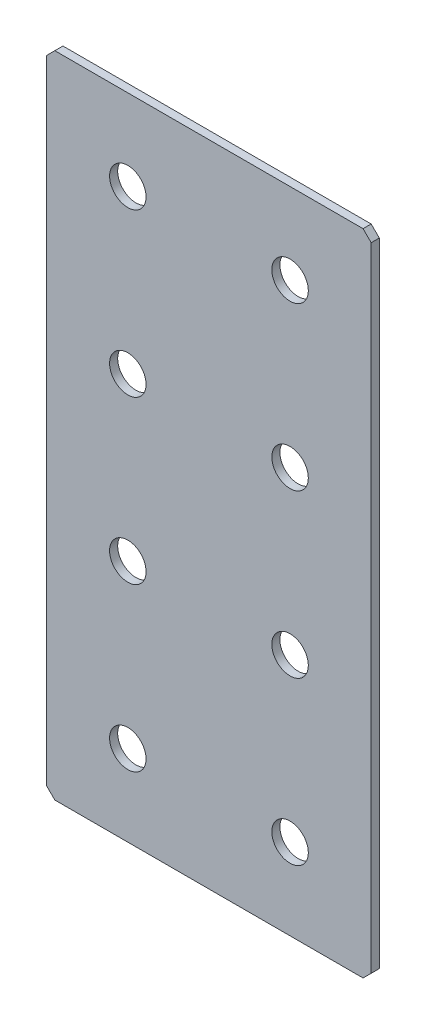
ISO-10303-21;
HEADER;
FILE_DESCRIPTION(('STEP AP214'),'2;1');
FILE_NAME('part.step','',(''),(''),'','','');
FILE_SCHEMA(('AUTOMOTIVE_DESIGN { 1 0 10303 214 1 1 1 1 }'));
ENDSEC;
DATA;
#1=APPLICATION_CONTEXT('core data for automotive mechanical design processes');
#2=APPLICATION_PROTOCOL_DEFINITION('international standard','automotive_design',2000,#1);
#3=PRODUCT_CONTEXT('',#1,'mechanical');
#4=PRODUCT('Part','Part','',(#3));
#5=PRODUCT_RELATED_PRODUCT_CATEGORY('part','',(#4));
#6=PRODUCT_DEFINITION_FORMATION('','',#4);
#7=PRODUCT_DEFINITION_CONTEXT('part definition',#1,'design');
#8=PRODUCT_DEFINITION('design','',#6,#7);
#9=PRODUCT_DEFINITION_SHAPE('','',#8);
#10=(LENGTH_UNIT() NAMED_UNIT(*) SI_UNIT(.MILLI.,.METRE.));
#11=(NAMED_UNIT(*) PLANE_ANGLE_UNIT() SI_UNIT($,.RADIAN.));
#12=(NAMED_UNIT(*) SI_UNIT($,.STERADIAN.) SOLID_ANGLE_UNIT());
#13=UNCERTAINTY_MEASURE_WITH_UNIT(LENGTH_MEASURE(1.E-05),#10,'distance_accuracy_value','');
#14=(GEOMETRIC_REPRESENTATION_CONTEXT(3) GLOBAL_UNCERTAINTY_ASSIGNED_CONTEXT((#13)) GLOBAL_UNIT_ASSIGNED_CONTEXT((#10,
#11,#12)) REPRESENTATION_CONTEXT('',''));
#15=CARTESIAN_POINT('',(0.,0.,0.));
#16=DIRECTION('',(0.,0.,1.));
#17=DIRECTION('',(1.,0.,0.));
#18=AXIS2_PLACEMENT_3D('',#15,#16,#17);
#19=CARTESIAN_POINT('',(40.,-80.,2.));
#20=DIRECTION('',(-1.,0.,0.));
#21=DIRECTION('',(0.,0.,1.));
#22=AXIS2_PLACEMENT_3D('',#19,#20,#21);
#23=PLANE('',#22);
#24=DIRECTION('',(0.,1.,0.));
#25=VECTOR('',#24,1.);
#26=CARTESIAN_POINT('',(40.,-80.,2.));
#27=LINE('',#26,#25);
#28=CARTESIAN_POINT('',(40.,-78.,2.));
#29=VERTEX_POINT('',#28);
#30=CARTESIAN_POINT('',(40.,78.,2.));
#31=VERTEX_POINT('',#30);
#32=EDGE_CURVE('E128',#29,#31,#27,.T.);
#33=ORIENTED_EDGE('',*,*,#32,.F.);
#34=DIRECTION('',(0.,0.,-1.));
#35=VECTOR('',#34,1.);
#36=CARTESIAN_POINT('',(40.,-78.,2.));
#37=LINE('',#36,#35);
#38=CARTESIAN_POINT('',(40.,-78.,0.));
#39=VERTEX_POINT('',#38);
#40=EDGE_CURVE('E154',#29,#39,#37,.T.);
#41=ORIENTED_EDGE('',*,*,#40,.T.);
#42=DIRECTION('',(0.,1.,0.));
#43=VECTOR('',#42,1.);
#44=CARTESIAN_POINT('',(40.,-80.,0.));
#45=LINE('',#44,#43);
#46=CARTESIAN_POINT('',(40.,78.,0.));
#47=VERTEX_POINT('',#46);
#48=EDGE_CURVE('E162',#39,#47,#45,.T.);
#49=ORIENTED_EDGE('',*,*,#48,.T.);
#50=DIRECTION('',(0.,0.,1.));
#51=VECTOR('',#50,1.);
#52=CARTESIAN_POINT('',(40.,78.,2.));
#53=LINE('',#52,#51);
#54=EDGE_CURVE('E152',#47,#31,#53,.T.);
#55=ORIENTED_EDGE('',*,*,#54,.T.);
#56=EDGE_LOOP('',(#33,#41,#49,#55));
#57=FACE_BOUND('',#56,.T.);
#58=ADVANCED_FACE('F37',(#57),#23,.F.);
#59=CARTESIAN_POINT('',(-40.,80.,2.));
#60=DIRECTION('',(0.,-1.,0.));
#61=DIRECTION('',(0.,0.,-1.));
#62=AXIS2_PLACEMENT_3D('',#59,#60,#61);
#63=PLANE('',#62);
#64=DIRECTION('',(-1.,0.,0.));
#65=VECTOR('',#64,1.);
#66=CARTESIAN_POINT('',(-40.,80.,0.));
#67=LINE('',#66,#65);
#68=CARTESIAN_POINT('',(38.,80.,0.));
#69=VERTEX_POINT('',#68);
#70=CARTESIAN_POINT('',(-38.,80.,0.));
#71=VERTEX_POINT('',#70);
#72=EDGE_CURVE('E133',#69,#71,#67,.T.);
#73=ORIENTED_EDGE('',*,*,#72,.T.);
#74=DIRECTION('',(0.,0.,1.));
#75=VECTOR('',#74,1.);
#76=CARTESIAN_POINT('',(-38.,80.,2.));
#77=LINE('',#76,#75);
#78=CARTESIAN_POINT('',(-38.,80.,2.));
#79=VERTEX_POINT('',#78);
#80=EDGE_CURVE('E11',#71,#79,#77,.T.);
#81=ORIENTED_EDGE('',*,*,#80,.T.);
#82=DIRECTION('',(-1.,0.,0.));
#83=VECTOR('',#82,1.);
#84=CARTESIAN_POINT('',(-40.,80.,2.));
#85=LINE('',#84,#83);
#86=CARTESIAN_POINT('',(38.,80.,2.));
#87=VERTEX_POINT('',#86);
#88=EDGE_CURVE('E131',#87,#79,#85,.T.);
#89=ORIENTED_EDGE('',*,*,#88,.F.);
#90=DIRECTION('',(0.,0.,-1.));
#91=VECTOR('',#90,1.);
#92=CARTESIAN_POINT('',(38.,80.,2.));
#93=LINE('',#92,#91);
#94=EDGE_CURVE('E45',#87,#69,#93,.T.);
#95=ORIENTED_EDGE('',*,*,#94,.T.);
#96=EDGE_LOOP('',(#73,#81,#89,#95));
#97=FACE_BOUND('',#96,.T.);
#98=ADVANCED_FACE('F159',(#97),#63,.F.);
#99=CARTESIAN_POINT('',(-40.,-80.,2.));
#100=DIRECTION('',(1.,0.,0.));
#101=DIRECTION('',(0.,0.,-1.));
#102=AXIS2_PLACEMENT_3D('',#99,#100,#101);
#103=PLANE('',#102);
#104=DIRECTION('',(0.,-1.,0.));
#105=VECTOR('',#104,1.);
#106=CARTESIAN_POINT('',(-40.,-80.,0.));
#107=LINE('',#106,#105);
#108=CARTESIAN_POINT('',(-40.,78.,0.));
#109=VERTEX_POINT('',#108);
#110=CARTESIAN_POINT('',(-40.,-78.,0.));
#111=VERTEX_POINT('',#110);
#112=EDGE_CURVE('E129',#109,#111,#107,.T.);
#113=ORIENTED_EDGE('',*,*,#112,.T.);
#114=DIRECTION('',(0.,0.,1.));
#115=VECTOR('',#114,1.);
#116=CARTESIAN_POINT('',(-40.,-78.,2.));
#117=LINE('',#116,#115);
#118=CARTESIAN_POINT('',(-40.,-78.,2.));
#119=VERTEX_POINT('',#118);
#120=EDGE_CURVE('E107',#111,#119,#117,.T.);
#121=ORIENTED_EDGE('',*,*,#120,.T.);
#122=DIRECTION('',(0.,-1.,0.));
#123=VECTOR('',#122,1.);
#124=CARTESIAN_POINT('',(-40.,-80.,2.));
#125=LINE('',#124,#123);
#126=CARTESIAN_POINT('',(-40.,78.,2.));
#127=VERTEX_POINT('',#126);
#128=EDGE_CURVE('E167',#127,#119,#125,.T.);
#129=ORIENTED_EDGE('',*,*,#128,.F.);
#130=DIRECTION('',(0.,0.,-1.));
#131=VECTOR('',#130,1.);
#132=CARTESIAN_POINT('',(-40.,78.,2.));
#133=LINE('',#132,#131);
#134=EDGE_CURVE('E112',#127,#109,#133,.T.);
#135=ORIENTED_EDGE('',*,*,#134,.T.);
#136=EDGE_LOOP('',(#113,#121,#129,#135));
#137=FACE_BOUND('',#136,.T.);
#138=ADVANCED_FACE('F242',(#137),#103,.F.);
#139=CARTESIAN_POINT('',(-40.,-80.,2.));
#140=DIRECTION('',(0.,1.,0.));
#141=DIRECTION('',(0.,0.,1.));
#142=AXIS2_PLACEMENT_3D('',#139,#140,#141);
#143=PLANE('',#142);
#144=DIRECTION('',(1.,0.,0.));
#145=VECTOR('',#144,1.);
#146=CARTESIAN_POINT('',(-40.,-80.,2.));
#147=LINE('',#146,#145);
#148=CARTESIAN_POINT('',(-38.,-80.,2.));
#149=VERTEX_POINT('',#148);
#150=CARTESIAN_POINT('',(38.,-80.,2.));
#151=VERTEX_POINT('',#150);
#152=EDGE_CURVE('E122',#149,#151,#147,.T.);
#153=ORIENTED_EDGE('',*,*,#152,.F.);
#154=DIRECTION('',(0.,0.,-1.));
#155=VECTOR('',#154,1.);
#156=CARTESIAN_POINT('',(-38.,-80.,2.));
#157=LINE('',#156,#155);
#158=CARTESIAN_POINT('',(-38.,-80.,0.));
#159=VERTEX_POINT('',#158);
#160=EDGE_CURVE('E106',#149,#159,#157,.T.);
#161=ORIENTED_EDGE('',*,*,#160,.T.);
#162=DIRECTION('',(1.,0.,0.));
#163=VECTOR('',#162,1.);
#164=CARTESIAN_POINT('',(-40.,-80.,0.));
#165=LINE('',#164,#163);
#166=CARTESIAN_POINT('',(38.,-80.,0.));
#167=VERTEX_POINT('',#166);
#168=EDGE_CURVE('E119',#159,#167,#165,.T.);
#169=ORIENTED_EDGE('',*,*,#168,.T.);
#170=DIRECTION('',(0.,0.,1.));
#171=VECTOR('',#170,1.);
#172=CARTESIAN_POINT('',(38.,-80.,2.));
#173=LINE('',#172,#171);
#174=EDGE_CURVE('E124',#167,#151,#173,.T.);
#175=ORIENTED_EDGE('',*,*,#174,.T.);
#176=EDGE_LOOP('',(#153,#161,#169,#175));
#177=FACE_BOUND('',#176,.T.);
#178=ADVANCED_FACE('F118',(#177),#143,.F.);
#179=CARTESIAN_POINT('',(0.,0.,2.));
#180=DIRECTION('',(0.,0.,-1.));
#181=DIRECTION('',(-1.,0.,0.));
#182=AXIS2_PLACEMENT_3D('',#179,#180,#181);
#183=PLANE('',#182);
#184=CARTESIAN_POINT('',(-20.,20.,2.));
#185=DIRECTION('',(0.,0.,1.));
#186=DIRECTION('',(1.,0.,0.));
#187=AXIS2_PLACEMENT_3D('',#184,#185,#186);
#188=CIRCLE('',#187,4.5);
#189=CARTESIAN_POINT('',(-15.5,20.,2.));
#190=VERTEX_POINT('',#189);
#191=EDGE_CURVE('E215',#190,#190,#188,.T.);
#192=ORIENTED_EDGE('',*,*,#191,.F.);
#193=EDGE_LOOP('',(#192));
#194=FACE_BOUND('',#193,.T.);
#195=CARTESIAN_POINT('',(20.,20.,2.));
#196=DIRECTION('',(0.,0.,1.));
#197=DIRECTION('',(1.,0.,0.));
#198=AXIS2_PLACEMENT_3D('',#195,#196,#197);
#199=CIRCLE('',#198,4.5);
#200=CARTESIAN_POINT('',(24.5,20.,2.));
#201=VERTEX_POINT('',#200);
#202=EDGE_CURVE('E209',#201,#201,#199,.T.);
#203=ORIENTED_EDGE('',*,*,#202,.F.);
#204=EDGE_LOOP('',(#203));
#205=FACE_BOUND('',#204,.T.);
#206=CARTESIAN_POINT('',(-20.,-20.,2.));
#207=DIRECTION('',(0.,0.,1.));
#208=DIRECTION('',(1.,0.,0.));
#209=AXIS2_PLACEMENT_3D('',#206,#207,#208);
#210=CIRCLE('',#209,4.5);
#211=CARTESIAN_POINT('',(-15.5,-20.,2.));
#212=VERTEX_POINT('',#211);
#213=EDGE_CURVE('E203',#212,#212,#210,.T.);
#214=ORIENTED_EDGE('',*,*,#213,.F.);
#215=EDGE_LOOP('',(#214));
#216=FACE_BOUND('',#215,.T.);
#217=CARTESIAN_POINT('',(20.,-20.,2.));
#218=DIRECTION('',(0.,0.,1.));
#219=DIRECTION('',(1.,0.,0.));
#220=AXIS2_PLACEMENT_3D('',#217,#218,#219);
#221=CIRCLE('',#220,4.5);
#222=CARTESIAN_POINT('',(24.5,-20.,2.));
#223=VERTEX_POINT('',#222);
#224=EDGE_CURVE('E197',#223,#223,#221,.T.);
#225=ORIENTED_EDGE('',*,*,#224,.F.);
#226=EDGE_LOOP('',(#225));
#227=FACE_BOUND('',#226,.T.);
#228=CARTESIAN_POINT('',(-20.,60.,2.));
#229=DIRECTION('',(0.,0.,1.));
#230=DIRECTION('',(1.,0.,0.));
#231=AXIS2_PLACEMENT_3D('',#228,#229,#230);
#232=CIRCLE('',#231,4.5);
#233=CARTESIAN_POINT('',(-15.5,60.,2.));
#234=VERTEX_POINT('',#233);
#235=EDGE_CURVE('E191',#234,#234,#232,.T.);
#236=ORIENTED_EDGE('',*,*,#235,.F.);
#237=EDGE_LOOP('',(#236));
#238=FACE_BOUND('',#237,.T.);
#239=CARTESIAN_POINT('',(20.,60.,2.));
#240=DIRECTION('',(0.,0.,1.));
#241=DIRECTION('',(1.,0.,0.));
#242=AXIS2_PLACEMENT_3D('',#239,#240,#241);
#243=CIRCLE('',#242,4.5);
#244=CARTESIAN_POINT('',(24.5,60.,2.));
#245=VERTEX_POINT('',#244);
#246=EDGE_CURVE('E185',#245,#245,#243,.T.);
#247=ORIENTED_EDGE('',*,*,#246,.F.);
#248=EDGE_LOOP('',(#247));
#249=FACE_BOUND('',#248,.T.);
#250=CARTESIAN_POINT('',(20.,-60.,2.));
#251=DIRECTION('',(0.,0.,1.));
#252=DIRECTION('',(1.,0.,0.));
#253=AXIS2_PLACEMENT_3D('',#250,#251,#252);
#254=CIRCLE('',#253,4.5);
#255=CARTESIAN_POINT('',(24.5,-60.,2.));
#256=VERTEX_POINT('',#255);
#257=EDGE_CURVE('E179',#256,#256,#254,.T.);
#258=ORIENTED_EDGE('',*,*,#257,.F.);
#259=EDGE_LOOP('',(#258));
#260=FACE_BOUND('',#259,.T.);
#261=CARTESIAN_POINT('',(-20.,-60.,2.));
#262=DIRECTION('',(0.,0.,1.));
#263=DIRECTION('',(1.,0.,0.));
#264=AXIS2_PLACEMENT_3D('',#261,#262,#263);
#265=CIRCLE('',#264,4.5);
#266=CARTESIAN_POINT('',(-15.5,-60.,2.));
#267=VERTEX_POINT('',#266);
#268=EDGE_CURVE('E173',#267,#267,#265,.T.);
#269=ORIENTED_EDGE('',*,*,#268,.F.);
#270=EDGE_LOOP('',(#269));
#271=FACE_BOUND('',#270,.T.);
#272=ORIENTED_EDGE('',*,*,#128,.T.);
#273=DIRECTION('',(-0.707106781186543,0.707106781186552,0.));
#274=VECTOR('',#273,1.);
#275=CARTESIAN_POINT('',(-38.,-80.,2.));
#276=LINE('',#275,#274);
#277=EDGE_CURVE('E150',#119,#149,#276,.F.);
#278=ORIENTED_EDGE('',*,*,#277,.T.);
#279=ORIENTED_EDGE('',*,*,#152,.T.);
#280=DIRECTION('',(-0.707106781186552,-0.707106781186543,0.));
#281=VECTOR('',#280,1.);
#282=CARTESIAN_POINT('',(40.,-78.,2.));
#283=LINE('',#282,#281);
#284=EDGE_CURVE('E148',#151,#29,#283,.F.);
#285=ORIENTED_EDGE('',*,*,#284,.T.);
#286=ORIENTED_EDGE('',*,*,#32,.T.);
#287=DIRECTION('',(0.707106781186543,-0.707106781186552,0.));
#288=VECTOR('',#287,1.);
#289=CARTESIAN_POINT('',(38.,80.,2.));
#290=LINE('',#289,#288);
#291=EDGE_CURVE('E57',#31,#87,#290,.F.);
#292=ORIENTED_EDGE('',*,*,#291,.T.);
#293=ORIENTED_EDGE('',*,*,#88,.T.);
#294=DIRECTION('',(0.707106781186552,0.707106781186543,0.));
#295=VECTOR('',#294,1.);
#296=CARTESIAN_POINT('',(-40.,78.,2.));
#297=LINE('',#296,#295);
#298=EDGE_CURVE('E146',#79,#127,#297,.F.);
#299=ORIENTED_EDGE('',*,*,#298,.T.);
#300=EDGE_LOOP('',(#272,#278,#279,#285,#286,#292,#293,#299));
#301=FACE_BOUND('',#300,.T.);
#302=ADVANCED_FACE('F221',(#194,#205,#216,#227,#238,#249,#260,#271,#301),#183,.F.);
#303=CARTESIAN_POINT('',(0.,0.,0.));
#304=DIRECTION('',(0.,0.,-1.));
#305=DIRECTION('',(-1.,0.,0.));
#306=AXIS2_PLACEMENT_3D('',#303,#304,#305);
#307=PLANE('',#306);
#308=CARTESIAN_POINT('',(-20.,20.,0.));
#309=DIRECTION('',(0.,0.,1.));
#310=DIRECTION('',(1.,0.,0.));
#311=AXIS2_PLACEMENT_3D('',#308,#309,#310);
#312=CIRCLE('',#311,4.5);
#313=CARTESIAN_POINT('',(-15.5,20.,0.));
#314=VERTEX_POINT('',#313);
#315=EDGE_CURVE('E212',#314,#314,#312,.T.);
#316=ORIENTED_EDGE('',*,*,#315,.T.);
#317=EDGE_LOOP('',(#316));
#318=FACE_BOUND('',#317,.T.);
#319=CARTESIAN_POINT('',(20.,20.,0.));
#320=DIRECTION('',(0.,0.,1.));
#321=DIRECTION('',(1.,0.,0.));
#322=AXIS2_PLACEMENT_3D('',#319,#320,#321);
#323=CIRCLE('',#322,4.5);
#324=CARTESIAN_POINT('',(24.5,20.,0.));
#325=VERTEX_POINT('',#324);
#326=EDGE_CURVE('E206',#325,#325,#323,.T.);
#327=ORIENTED_EDGE('',*,*,#326,.T.);
#328=EDGE_LOOP('',(#327));
#329=FACE_BOUND('',#328,.T.);
#330=CARTESIAN_POINT('',(-20.,-20.,0.));
#331=DIRECTION('',(0.,0.,1.));
#332=DIRECTION('',(1.,0.,0.));
#333=AXIS2_PLACEMENT_3D('',#330,#331,#332);
#334=CIRCLE('',#333,4.5);
#335=CARTESIAN_POINT('',(-15.5,-20.,0.));
#336=VERTEX_POINT('',#335);
#337=EDGE_CURVE('E200',#336,#336,#334,.T.);
#338=ORIENTED_EDGE('',*,*,#337,.T.);
#339=EDGE_LOOP('',(#338));
#340=FACE_BOUND('',#339,.T.);
#341=CARTESIAN_POINT('',(20.,-20.,0.));
#342=DIRECTION('',(0.,0.,1.));
#343=DIRECTION('',(1.,0.,0.));
#344=AXIS2_PLACEMENT_3D('',#341,#342,#343);
#345=CIRCLE('',#344,4.5);
#346=CARTESIAN_POINT('',(24.5,-20.,0.));
#347=VERTEX_POINT('',#346);
#348=EDGE_CURVE('E194',#347,#347,#345,.T.);
#349=ORIENTED_EDGE('',*,*,#348,.T.);
#350=EDGE_LOOP('',(#349));
#351=FACE_BOUND('',#350,.T.);
#352=CARTESIAN_POINT('',(-20.,60.,0.));
#353=DIRECTION('',(0.,0.,1.));
#354=DIRECTION('',(1.,0.,0.));
#355=AXIS2_PLACEMENT_3D('',#352,#353,#354);
#356=CIRCLE('',#355,4.5);
#357=CARTESIAN_POINT('',(-15.5,60.,0.));
#358=VERTEX_POINT('',#357);
#359=EDGE_CURVE('E188',#358,#358,#356,.T.);
#360=ORIENTED_EDGE('',*,*,#359,.T.);
#361=EDGE_LOOP('',(#360));
#362=FACE_BOUND('',#361,.T.);
#363=CARTESIAN_POINT('',(20.,60.,0.));
#364=DIRECTION('',(0.,0.,1.));
#365=DIRECTION('',(1.,0.,0.));
#366=AXIS2_PLACEMENT_3D('',#363,#364,#365);
#367=CIRCLE('',#366,4.5);
#368=CARTESIAN_POINT('',(24.5,60.,0.));
#369=VERTEX_POINT('',#368);
#370=EDGE_CURVE('E182',#369,#369,#367,.T.);
#371=ORIENTED_EDGE('',*,*,#370,.T.);
#372=EDGE_LOOP('',(#371));
#373=FACE_BOUND('',#372,.T.);
#374=CARTESIAN_POINT('',(20.,-60.,0.));
#375=DIRECTION('',(0.,0.,1.));
#376=DIRECTION('',(1.,0.,0.));
#377=AXIS2_PLACEMENT_3D('',#374,#375,#376);
#378=CIRCLE('',#377,4.5);
#379=CARTESIAN_POINT('',(24.5,-60.,0.));
#380=VERTEX_POINT('',#379);
#381=EDGE_CURVE('E176',#380,#380,#378,.T.);
#382=ORIENTED_EDGE('',*,*,#381,.T.);
#383=EDGE_LOOP('',(#382));
#384=FACE_BOUND('',#383,.T.);
#385=CARTESIAN_POINT('',(-20.,-60.,0.));
#386=DIRECTION('',(0.,0.,1.));
#387=DIRECTION('',(1.,0.,0.));
#388=AXIS2_PLACEMENT_3D('',#385,#386,#387);
#389=CIRCLE('',#388,4.5);
#390=CARTESIAN_POINT('',(-15.5,-60.,0.));
#391=VERTEX_POINT('',#390);
#392=EDGE_CURVE('E163',#391,#391,#389,.T.);
#393=ORIENTED_EDGE('',*,*,#392,.T.);
#394=EDGE_LOOP('',(#393));
#395=FACE_BOUND('',#394,.T.);
#396=ORIENTED_EDGE('',*,*,#168,.F.);
#397=DIRECTION('',(0.707106781186543,-0.707106781186552,0.));
#398=VECTOR('',#397,1.);
#399=CARTESIAN_POINT('',(-59.0000000000003,-58.9999999999995,0.));
#400=LINE('',#399,#398);
#401=EDGE_CURVE('E102',#159,#111,#400,.F.);
#402=ORIENTED_EDGE('',*,*,#401,.T.);
#403=ORIENTED_EDGE('',*,*,#112,.F.);
#404=DIRECTION('',(-0.707106781186552,-0.707106781186543,0.));
#405=VECTOR('',#404,1.);
#406=CARTESIAN_POINT('',(-58.9999999999997,59.0000000000005,0.));
#407=LINE('',#406,#405);
#408=EDGE_CURVE('E139',#109,#71,#407,.F.);
#409=ORIENTED_EDGE('',*,*,#408,.T.);
#410=ORIENTED_EDGE('',*,*,#72,.F.);
#411=DIRECTION('',(-0.707106781186543,0.707106781186552,0.));
#412=VECTOR('',#411,1.);
#413=CARTESIAN_POINT('',(59.0000000000003,58.9999999999994,0.));
#414=LINE('',#413,#412);
#415=EDGE_CURVE('E123',#69,#47,#414,.F.);
#416=ORIENTED_EDGE('',*,*,#415,.T.);
#417=ORIENTED_EDGE('',*,*,#48,.F.);
#418=DIRECTION('',(0.707106781186552,0.707106781186543,0.));
#419=VECTOR('',#418,1.);
#420=CARTESIAN_POINT('',(58.9999999999997,-59.0000000000006,0.));
#421=LINE('',#420,#419);
#422=EDGE_CURVE('E113',#39,#167,#421,.F.);
#423=ORIENTED_EDGE('',*,*,#422,.T.);
#424=EDGE_LOOP('',(#396,#402,#403,#409,#410,#416,#417,#423));
#425=FACE_BOUND('',#424,.T.);
#426=ADVANCED_FACE('F126',(#318,#329,#340,#351,#362,#373,#384,#395,#425),#307,.T.);
#427=CARTESIAN_POINT('',(-38.,-80.,2.));
#428=DIRECTION('',(0.707106781186552,0.707106781186542,0.));
#429=DIRECTION('',(0.,0.,-1.));
#430=AXIS2_PLACEMENT_3D('',#427,#428,#429);
#431=PLANE('',#430);
#432=ORIENTED_EDGE('',*,*,#277,.F.);
#433=ORIENTED_EDGE('',*,*,#120,.F.);
#434=ORIENTED_EDGE('',*,*,#401,.F.);
#435=ORIENTED_EDGE('',*,*,#160,.F.);
#436=EDGE_LOOP('',(#432,#433,#434,#435));
#437=FACE_BOUND('',#436,.T.);
#438=ADVANCED_FACE('F105',(#437),#431,.F.);
#439=CARTESIAN_POINT('',(40.,-78.,2.));
#440=DIRECTION('',(-0.707106781186542,0.707106781186552,0.));
#441=DIRECTION('',(0.,0.,-1.));
#442=AXIS2_PLACEMENT_3D('',#439,#440,#441);
#443=PLANE('',#442);
#444=ORIENTED_EDGE('',*,*,#284,.F.);
#445=ORIENTED_EDGE('',*,*,#174,.F.);
#446=ORIENTED_EDGE('',*,*,#422,.F.);
#447=ORIENTED_EDGE('',*,*,#40,.F.);
#448=EDGE_LOOP('',(#444,#445,#446,#447));
#449=FACE_BOUND('',#448,.T.);
#450=ADVANCED_FACE('F246',(#449),#443,.F.);
#451=CARTESIAN_POINT('',(-40.,78.,2.));
#452=DIRECTION('',(0.707106781186542,-0.707106781186552,0.));
#453=DIRECTION('',(0.,0.,-1.));
#454=AXIS2_PLACEMENT_3D('',#451,#452,#453);
#455=PLANE('',#454);
#456=ORIENTED_EDGE('',*,*,#298,.F.);
#457=ORIENTED_EDGE('',*,*,#80,.F.);
#458=ORIENTED_EDGE('',*,*,#408,.F.);
#459=ORIENTED_EDGE('',*,*,#134,.F.);
#460=EDGE_LOOP('',(#456,#457,#458,#459));
#461=FACE_BOUND('',#460,.T.);
#462=ADVANCED_FACE('F244',(#461),#455,.F.);
#463=CARTESIAN_POINT('',(38.,80.,2.));
#464=DIRECTION('',(-0.707106781186552,-0.707106781186542,0.));
#465=DIRECTION('',(0.,0.,-1.));
#466=AXIS2_PLACEMENT_3D('',#463,#464,#465);
#467=PLANE('',#466);
#468=ORIENTED_EDGE('',*,*,#291,.F.);
#469=ORIENTED_EDGE('',*,*,#54,.F.);
#470=ORIENTED_EDGE('',*,*,#415,.F.);
#471=ORIENTED_EDGE('',*,*,#94,.F.);
#472=EDGE_LOOP('',(#468,#469,#470,#471));
#473=FACE_BOUND('',#472,.T.);
#474=ADVANCED_FACE('F39',(#473),#467,.F.);
#475=CARTESIAN_POINT('',(-20.,-60.,2.));
#476=DIRECTION('',(0.,0.,1.));
#477=DIRECTION('',(1.,0.,0.));
#478=AXIS2_PLACEMENT_3D('',#475,#476,#477);
#479=CYLINDRICAL_SURFACE('',#478,4.5);
#480=ORIENTED_EDGE('',*,*,#392,.F.);
#481=EDGE_LOOP('',(#480));
#482=FACE_BOUND('',#481,.T.);
#483=ORIENTED_EDGE('',*,*,#268,.T.);
#484=EDGE_LOOP('',(#483));
#485=FACE_BOUND('',#484,.T.);
#486=ADVANCED_FACE('F251',(#482,#485),#479,.F.);
#487=CARTESIAN_POINT('',(20.,-60.,2.));
#488=DIRECTION('',(0.,0.,1.));
#489=DIRECTION('',(1.,0.,0.));
#490=AXIS2_PLACEMENT_3D('',#487,#488,#489);
#491=CYLINDRICAL_SURFACE('',#490,4.5);
#492=ORIENTED_EDGE('',*,*,#381,.F.);
#493=EDGE_LOOP('',(#492));
#494=FACE_BOUND('',#493,.T.);
#495=ORIENTED_EDGE('',*,*,#257,.T.);
#496=EDGE_LOOP('',(#495));
#497=FACE_BOUND('',#496,.T.);
#498=ADVANCED_FACE('F306',(#494,#497),#491,.F.);
#499=CARTESIAN_POINT('',(20.,60.,2.));
#500=DIRECTION('',(0.,0.,1.));
#501=DIRECTION('',(1.,0.,0.));
#502=AXIS2_PLACEMENT_3D('',#499,#500,#501);
#503=CYLINDRICAL_SURFACE('',#502,4.5);
#504=ORIENTED_EDGE('',*,*,#370,.F.);
#505=EDGE_LOOP('',(#504));
#506=FACE_BOUND('',#505,.T.);
#507=ORIENTED_EDGE('',*,*,#246,.T.);
#508=EDGE_LOOP('',(#507));
#509=FACE_BOUND('',#508,.T.);
#510=ADVANCED_FACE('F315',(#506,#509),#503,.F.);
#511=CARTESIAN_POINT('',(-20.,60.,2.));
#512=DIRECTION('',(0.,0.,1.));
#513=DIRECTION('',(1.,0.,0.));
#514=AXIS2_PLACEMENT_3D('',#511,#512,#513);
#515=CYLINDRICAL_SURFACE('',#514,4.5);
#516=ORIENTED_EDGE('',*,*,#359,.F.);
#517=EDGE_LOOP('',(#516));
#518=FACE_BOUND('',#517,.T.);
#519=ORIENTED_EDGE('',*,*,#235,.T.);
#520=EDGE_LOOP('',(#519));
#521=FACE_BOUND('',#520,.T.);
#522=ADVANCED_FACE('F325',(#518,#521),#515,.F.);
#523=CARTESIAN_POINT('',(20.,-20.,2.));
#524=DIRECTION('',(0.,0.,1.));
#525=DIRECTION('',(1.,0.,0.));
#526=AXIS2_PLACEMENT_3D('',#523,#524,#525);
#527=CYLINDRICAL_SURFACE('',#526,4.5);
#528=ORIENTED_EDGE('',*,*,#348,.F.);
#529=EDGE_LOOP('',(#528));
#530=FACE_BOUND('',#529,.T.);
#531=ORIENTED_EDGE('',*,*,#224,.T.);
#532=EDGE_LOOP('',(#531));
#533=FACE_BOUND('',#532,.T.);
#534=ADVANCED_FACE('F335',(#530,#533),#527,.F.);
#535=CARTESIAN_POINT('',(-20.,-20.,2.));
#536=DIRECTION('',(0.,0.,1.));
#537=DIRECTION('',(1.,0.,0.));
#538=AXIS2_PLACEMENT_3D('',#535,#536,#537);
#539=CYLINDRICAL_SURFACE('',#538,4.5);
#540=ORIENTED_EDGE('',*,*,#337,.F.);
#541=EDGE_LOOP('',(#540));
#542=FACE_BOUND('',#541,.T.);
#543=ORIENTED_EDGE('',*,*,#213,.T.);
#544=EDGE_LOOP('',(#543));
#545=FACE_BOUND('',#544,.T.);
#546=ADVANCED_FACE('F345',(#542,#545),#539,.F.);
#547=CARTESIAN_POINT('',(20.,20.,2.));
#548=DIRECTION('',(0.,0.,1.));
#549=DIRECTION('',(1.,0.,0.));
#550=AXIS2_PLACEMENT_3D('',#547,#548,#549);
#551=CYLINDRICAL_SURFACE('',#550,4.5);
#552=ORIENTED_EDGE('',*,*,#326,.F.);
#553=EDGE_LOOP('',(#552));
#554=FACE_BOUND('',#553,.T.);
#555=ORIENTED_EDGE('',*,*,#202,.T.);
#556=EDGE_LOOP('',(#555));
#557=FACE_BOUND('',#556,.T.);
#558=ADVANCED_FACE('F355',(#554,#557),#551,.F.);
#559=CARTESIAN_POINT('',(-20.,20.,2.));
#560=DIRECTION('',(0.,0.,1.));
#561=DIRECTION('',(1.,0.,0.));
#562=AXIS2_PLACEMENT_3D('',#559,#560,#561);
#563=CYLINDRICAL_SURFACE('',#562,4.5);
#564=ORIENTED_EDGE('',*,*,#315,.F.);
#565=EDGE_LOOP('',(#564));
#566=FACE_BOUND('',#565,.T.);
#567=ORIENTED_EDGE('',*,*,#191,.T.);
#568=EDGE_LOOP('',(#567));
#569=FACE_BOUND('',#568,.T.);
#570=ADVANCED_FACE('F219',(#566,#569),#563,.F.);
#571=CLOSED_SHELL('',(#58,#98,#138,#178,#302,#426,#438,#450,#462,#474,#486,#498,#510,#522,#534,
#546,#558,#570));
#572=MANIFOLD_SOLID_BREP('B2',#571);
#573=ADVANCED_BREP_SHAPE_REPRESENTATION('',(#18,#572),#14);
#574=SHAPE_DEFINITION_REPRESENTATION(#9,#573);
ENDSEC;
END-ISO-10303-21;
